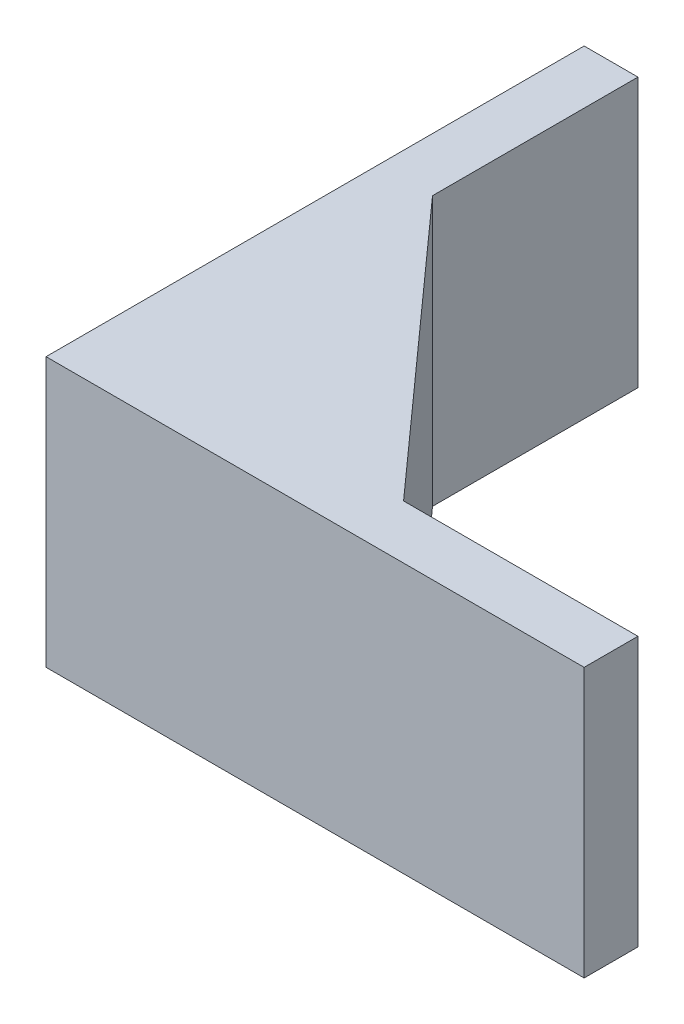
ISO-10303-21;
HEADER;
FILE_DESCRIPTION(('STEP AP214'),'2;1');
FILE_NAME('part.step','',(''),(''),'','','');
FILE_SCHEMA(('AUTOMOTIVE_DESIGN { 1 0 10303 214 1 1 1 1 }'));
ENDSEC;
DATA;
#1=APPLICATION_CONTEXT('core data for automotive mechanical design processes');
#2=APPLICATION_PROTOCOL_DEFINITION('international standard','automotive_design',2000,#1);
#3=PRODUCT_CONTEXT('',#1,'mechanical');
#4=PRODUCT('Part','Part','',(#3));
#5=PRODUCT_RELATED_PRODUCT_CATEGORY('part','',(#4));
#6=PRODUCT_DEFINITION_FORMATION('','',#4);
#7=PRODUCT_DEFINITION_CONTEXT('part definition',#1,'design');
#8=PRODUCT_DEFINITION('design','',#6,#7);
#9=PRODUCT_DEFINITION_SHAPE('','',#8);
#10=(LENGTH_UNIT() NAMED_UNIT(*) SI_UNIT(.MILLI.,.METRE.));
#11=(NAMED_UNIT(*) PLANE_ANGLE_UNIT() SI_UNIT($,.RADIAN.));
#12=(NAMED_UNIT(*) SI_UNIT($,.STERADIAN.) SOLID_ANGLE_UNIT());
#13=UNCERTAINTY_MEASURE_WITH_UNIT(LENGTH_MEASURE(1.E-05),#10,'distance_accuracy_value','');
#14=(GEOMETRIC_REPRESENTATION_CONTEXT(3) GLOBAL_UNCERTAINTY_ASSIGNED_CONTEXT((#13)) GLOBAL_UNIT_ASSIGNED_CONTEXT((#10,
#11,#12)) REPRESENTATION_CONTEXT('',''));
#15=CARTESIAN_POINT('',(0.,0.,0.));
#16=DIRECTION('',(0.,0.,1.));
#17=DIRECTION('',(1.,0.,0.));
#18=AXIS2_PLACEMENT_3D('',#15,#16,#17);
#19=CARTESIAN_POINT('',(4.,20.,-24.728267980885));
#20=DIRECTION('',(-1.,0.,0.));
#21=DIRECTION('',(0.,0.,1.));
#22=AXIS2_PLACEMENT_3D('',#19,#20,#21);
#23=PLANE('',#22);
#24=DIRECTION('',(0.,0.,-1.));
#25=VECTOR('',#24,1.);
#26=CARTESIAN_POINT('',(4.,0.,-24.728267980885));
#27=LINE('',#26,#25);
#28=CARTESIAN_POINT('',(4.,0.,-24.728267980885));
#29=VERTEX_POINT('',#28);
#30=CARTESIAN_POINT('',(4.,0.,-40.));
#31=VERTEX_POINT('',#30);
#32=EDGE_CURVE('E123',#29,#31,#27,.T.);
#33=ORIENTED_EDGE('',*,*,#32,.T.);
#34=DIRECTION('',(0.,-1.,0.));
#35=VECTOR('',#34,1.);
#36=CARTESIAN_POINT('',(4.,20.,-40.));
#37=LINE('',#36,#35);
#38=CARTESIAN_POINT('',(4.,20.,-40.));
#39=VERTEX_POINT('',#38);
#40=EDGE_CURVE('E11',#39,#31,#37,.T.);
#41=ORIENTED_EDGE('',*,*,#40,.F.);
#42=DIRECTION('',(0.,0.,-1.));
#43=VECTOR('',#42,1.);
#44=CARTESIAN_POINT('',(4.,20.,-24.728267980885));
#45=LINE('',#44,#43);
#46=CARTESIAN_POINT('',(4.,20.,-24.728267980885));
#47=VERTEX_POINT('',#46);
#48=EDGE_CURVE('E135',#47,#39,#45,.T.);
#49=ORIENTED_EDGE('',*,*,#48,.F.);
#50=DIRECTION('',(0.,-1.,0.));
#51=VECTOR('',#50,1.);
#52=CARTESIAN_POINT('',(4.,20.,-24.728267980885));
#53=LINE('',#52,#51);
#54=EDGE_CURVE('E119',#47,#29,#53,.T.);
#55=ORIENTED_EDGE('',*,*,#54,.T.);
#56=EDGE_LOOP('',(#33,#41,#49,#55));
#57=FACE_BOUND('',#56,.T.);
#58=ADVANCED_FACE('F33',(#57),#23,.F.);
#59=CARTESIAN_POINT('',(0.,20.,-40.));
#60=DIRECTION('',(0.,0.,1.));
#61=DIRECTION('',(1.,0.,0.));
#62=AXIS2_PLACEMENT_3D('',#59,#60,#61);
#63=PLANE('',#62);
#64=DIRECTION('',(-1.,0.,0.));
#65=VECTOR('',#64,1.);
#66=CARTESIAN_POINT('',(0.,0.,-40.));
#67=LINE('',#66,#65);
#68=CARTESIAN_POINT('',(0.,0.,-40.));
#69=VERTEX_POINT('',#68);
#70=EDGE_CURVE('E126',#31,#69,#67,.T.);
#71=ORIENTED_EDGE('',*,*,#70,.T.);
#72=DIRECTION('',(0.,-1.,0.));
#73=VECTOR('',#72,1.);
#74=CARTESIAN_POINT('',(0.,20.,-40.));
#75=LINE('',#74,#73);
#76=CARTESIAN_POINT('',(0.,20.,-40.));
#77=VERTEX_POINT('',#76);
#78=EDGE_CURVE('E41',#77,#69,#75,.T.);
#79=ORIENTED_EDGE('',*,*,#78,.F.);
#80=DIRECTION('',(-1.,0.,0.));
#81=VECTOR('',#80,1.);
#82=CARTESIAN_POINT('',(0.,20.,-40.));
#83=LINE('',#82,#81);
#84=EDGE_CURVE('E89',#39,#77,#83,.T.);
#85=ORIENTED_EDGE('',*,*,#84,.F.);
#86=ORIENTED_EDGE('',*,*,#40,.T.);
#87=EDGE_LOOP('',(#71,#79,#85,#86));
#88=FACE_BOUND('',#87,.T.);
#89=ADVANCED_FACE('F160',(#88),#63,.F.);
#90=CARTESIAN_POINT('',(0.,20.,-40.));
#91=DIRECTION('',(1.,0.,0.));
#92=DIRECTION('',(0.,0.,-1.));
#93=AXIS2_PLACEMENT_3D('',#90,#91,#92);
#94=PLANE('',#93);
#95=DIRECTION('',(0.,0.,1.));
#96=VECTOR('',#95,1.);
#97=CARTESIAN_POINT('',(0.,0.,-40.));
#98=LINE('',#97,#96);
#99=CARTESIAN_POINT('',(0.,0.,0.));
#100=VERTEX_POINT('',#99);
#101=EDGE_CURVE('E128',#69,#100,#98,.T.);
#102=ORIENTED_EDGE('',*,*,#101,.T.);
#103=DIRECTION('',(0.,-1.,0.));
#104=VECTOR('',#103,1.);
#105=CARTESIAN_POINT('',(0.,20.,0.));
#106=LINE('',#105,#104);
#107=CARTESIAN_POINT('',(0.,20.,0.));
#108=VERTEX_POINT('',#107);
#109=EDGE_CURVE('E139',#108,#100,#106,.T.);
#110=ORIENTED_EDGE('',*,*,#109,.F.);
#111=DIRECTION('',(0.,0.,1.));
#112=VECTOR('',#111,1.);
#113=CARTESIAN_POINT('',(0.,20.,-40.));
#114=LINE('',#113,#112);
#115=EDGE_CURVE('E147',#77,#108,#114,.T.);
#116=ORIENTED_EDGE('',*,*,#115,.F.);
#117=ORIENTED_EDGE('',*,*,#78,.T.);
#118=EDGE_LOOP('',(#102,#110,#116,#117));
#119=FACE_BOUND('',#118,.T.);
#120=ADVANCED_FACE('F145',(#119),#94,.F.);
#121=CARTESIAN_POINT('',(0.,20.,0.));
#122=DIRECTION('',(0.,0.,-1.));
#123=DIRECTION('',(-1.,0.,0.));
#124=AXIS2_PLACEMENT_3D('',#121,#122,#123);
#125=PLANE('',#124);
#126=DIRECTION('',(1.,0.,0.));
#127=VECTOR('',#126,1.);
#128=CARTESIAN_POINT('',(0.,0.,0.));
#129=LINE('',#128,#127);
#130=CARTESIAN_POINT('',(40.,0.,0.));
#131=VERTEX_POINT('',#130);
#132=EDGE_CURVE('E130',#100,#131,#129,.T.);
#133=ORIENTED_EDGE('',*,*,#132,.T.);
#134=DIRECTION('',(0.,-1.,0.));
#135=VECTOR('',#134,1.);
#136=CARTESIAN_POINT('',(40.,20.,0.));
#137=LINE('',#136,#135);
#138=CARTESIAN_POINT('',(40.,20.,0.));
#139=VERTEX_POINT('',#138);
#140=EDGE_CURVE('E114',#139,#131,#137,.T.);
#141=ORIENTED_EDGE('',*,*,#140,.F.);
#142=DIRECTION('',(1.,0.,0.));
#143=VECTOR('',#142,1.);
#144=CARTESIAN_POINT('',(0.,20.,0.));
#145=LINE('',#144,#143);
#146=EDGE_CURVE('E105',#108,#139,#145,.T.);
#147=ORIENTED_EDGE('',*,*,#146,.F.);
#148=ORIENTED_EDGE('',*,*,#109,.T.);
#149=EDGE_LOOP('',(#133,#141,#147,#148));
#150=FACE_BOUND('',#149,.T.);
#151=ADVANCED_FACE('F153',(#150),#125,.F.);
#152=CARTESIAN_POINT('',(40.,20.,0.));
#153=DIRECTION('',(-1.,0.,0.));
#154=DIRECTION('',(0.,0.,1.));
#155=AXIS2_PLACEMENT_3D('',#152,#153,#154);
#156=PLANE('',#155);
#157=DIRECTION('',(0.,0.,-1.));
#158=VECTOR('',#157,1.);
#159=CARTESIAN_POINT('',(40.,0.,0.));
#160=LINE('',#159,#158);
#161=CARTESIAN_POINT('',(40.,0.,-4.));
#162=VERTEX_POINT('',#161);
#163=EDGE_CURVE('E113',#131,#162,#160,.T.);
#164=ORIENTED_EDGE('',*,*,#163,.T.);
#165=DIRECTION('',(0.,-1.,0.));
#166=VECTOR('',#165,1.);
#167=CARTESIAN_POINT('',(40.,20.,-4.));
#168=LINE('',#167,#166);
#169=CARTESIAN_POINT('',(40.,20.,-4.));
#170=VERTEX_POINT('',#169);
#171=EDGE_CURVE('E110',#170,#162,#168,.T.);
#172=ORIENTED_EDGE('',*,*,#171,.F.);
#173=DIRECTION('',(0.,0.,-1.));
#174=VECTOR('',#173,1.);
#175=CARTESIAN_POINT('',(40.,20.,0.));
#176=LINE('',#175,#174);
#177=EDGE_CURVE('E99',#139,#170,#176,.T.);
#178=ORIENTED_EDGE('',*,*,#177,.F.);
#179=ORIENTED_EDGE('',*,*,#140,.T.);
#180=EDGE_LOOP('',(#164,#172,#178,#179));
#181=FACE_BOUND('',#180,.T.);
#182=ADVANCED_FACE('F111',(#181),#156,.F.);
#183=CARTESIAN_POINT('',(22.5765495176801,20.,-4.));
#184=DIRECTION('',(0.,0.,1.));
#185=DIRECTION('',(1.,0.,0.));
#186=AXIS2_PLACEMENT_3D('',#183,#184,#185);
#187=PLANE('',#186);
#188=DIRECTION('',(-1.,0.,0.));
#189=VECTOR('',#188,1.);
#190=CARTESIAN_POINT('',(22.5765495176801,0.,-4.));
#191=LINE('',#190,#189);
#192=CARTESIAN_POINT('',(22.5765495176801,0.,-4.));
#193=VERTEX_POINT('',#192);
#194=EDGE_CURVE('E75',#162,#193,#191,.T.);
#195=ORIENTED_EDGE('',*,*,#194,.T.);
#196=DIRECTION('',(0.,-1.,0.));
#197=VECTOR('',#196,1.);
#198=CARTESIAN_POINT('',(22.5765495176801,20.,-4.));
#199=LINE('',#198,#197);
#200=CARTESIAN_POINT('',(22.5765495176801,20.,-4.));
#201=VERTEX_POINT('',#200);
#202=EDGE_CURVE('E115',#201,#193,#199,.T.);
#203=ORIENTED_EDGE('',*,*,#202,.F.);
#204=DIRECTION('',(-1.,0.,0.));
#205=VECTOR('',#204,1.);
#206=CARTESIAN_POINT('',(22.5765495176801,20.,-4.));
#207=LINE('',#206,#205);
#208=EDGE_CURVE('E103',#170,#201,#207,.T.);
#209=ORIENTED_EDGE('',*,*,#208,.F.);
#210=ORIENTED_EDGE('',*,*,#171,.T.);
#211=EDGE_LOOP('',(#195,#203,#209,#210));
#212=FACE_BOUND('',#211,.T.);
#213=ADVANCED_FACE('F117',(#212),#187,.F.);
#214=CARTESIAN_POINT('',(4.,20.,-24.728267980885));
#215=DIRECTION('',(-0.744701832479953,0.,0.667397318470039));
#216=DIRECTION('',(0.667397318470039,0.,0.744701832479953));
#217=AXIS2_PLACEMENT_3D('',#214,#215,#216);
#218=PLANE('',#217);
#219=DIRECTION('',(-0.667397318470039,0.,-0.744701832479953));
#220=VECTOR('',#219,1.);
#221=CARTESIAN_POINT('',(4.,0.,-24.728267980885));
#222=LINE('',#221,#220);
#223=EDGE_CURVE('E81',#193,#29,#222,.T.);
#224=ORIENTED_EDGE('',*,*,#223,.T.);
#225=ORIENTED_EDGE('',*,*,#54,.F.);
#226=DIRECTION('',(-0.667397318470039,0.,-0.744701832479953));
#227=VECTOR('',#226,1.);
#228=CARTESIAN_POINT('',(4.,20.,-24.728267980885));
#229=LINE('',#228,#227);
#230=EDGE_CURVE('E49',#201,#47,#229,.T.);
#231=ORIENTED_EDGE('',*,*,#230,.F.);
#232=ORIENTED_EDGE('',*,*,#202,.T.);
#233=EDGE_LOOP('',(#224,#225,#231,#232));
#234=FACE_BOUND('',#233,.T.);
#235=ADVANCED_FACE('F174',(#234),#218,.F.);
#236=CARTESIAN_POINT('',(0.,20.,0.));
#237=DIRECTION('',(0.,-1.,0.));
#238=DIRECTION('',(0.,0.,-1.));
#239=AXIS2_PLACEMENT_3D('',#236,#237,#238);
#240=PLANE('',#239);
#241=ORIENTED_EDGE('',*,*,#48,.T.);
#242=ORIENTED_EDGE('',*,*,#84,.T.);
#243=ORIENTED_EDGE('',*,*,#115,.T.);
#244=ORIENTED_EDGE('',*,*,#146,.T.);
#245=ORIENTED_EDGE('',*,*,#177,.T.);
#246=ORIENTED_EDGE('',*,*,#208,.T.);
#247=ORIENTED_EDGE('',*,*,#230,.T.);
#248=EDGE_LOOP('',(#241,#242,#243,#244,#245,#246,#247));
#249=FACE_BOUND('',#248,.T.);
#250=ADVANCED_FACE('F101',(#249),#240,.F.);
#251=CARTESIAN_POINT('',(0.,0.,0.));
#252=DIRECTION('',(0.,-1.,0.));
#253=DIRECTION('',(0.,0.,-1.));
#254=AXIS2_PLACEMENT_3D('',#251,#252,#253);
#255=PLANE('',#254);
#256=ORIENTED_EDGE('',*,*,#32,.F.);
#257=ORIENTED_EDGE('',*,*,#223,.F.);
#258=ORIENTED_EDGE('',*,*,#194,.F.);
#259=ORIENTED_EDGE('',*,*,#163,.F.);
#260=ORIENTED_EDGE('',*,*,#132,.F.);
#261=ORIENTED_EDGE('',*,*,#101,.F.);
#262=ORIENTED_EDGE('',*,*,#70,.F.);
#263=EDGE_LOOP('',(#256,#257,#258,#259,#260,#261,#262));
#264=FACE_BOUND('',#263,.T.);
#265=ADVANCED_FACE('F151',(#264),#255,.T.);
#266=CLOSED_SHELL('',(#58,#89,#120,#151,#182,#213,#235,#250,#265));
#267=MANIFOLD_SOLID_BREP('B2',#266);
#268=ADVANCED_BREP_SHAPE_REPRESENTATION('',(#18,#267),#14);
#269=SHAPE_DEFINITION_REPRESENTATION(#9,#268);
ENDSEC;
END-ISO-10303-21;
